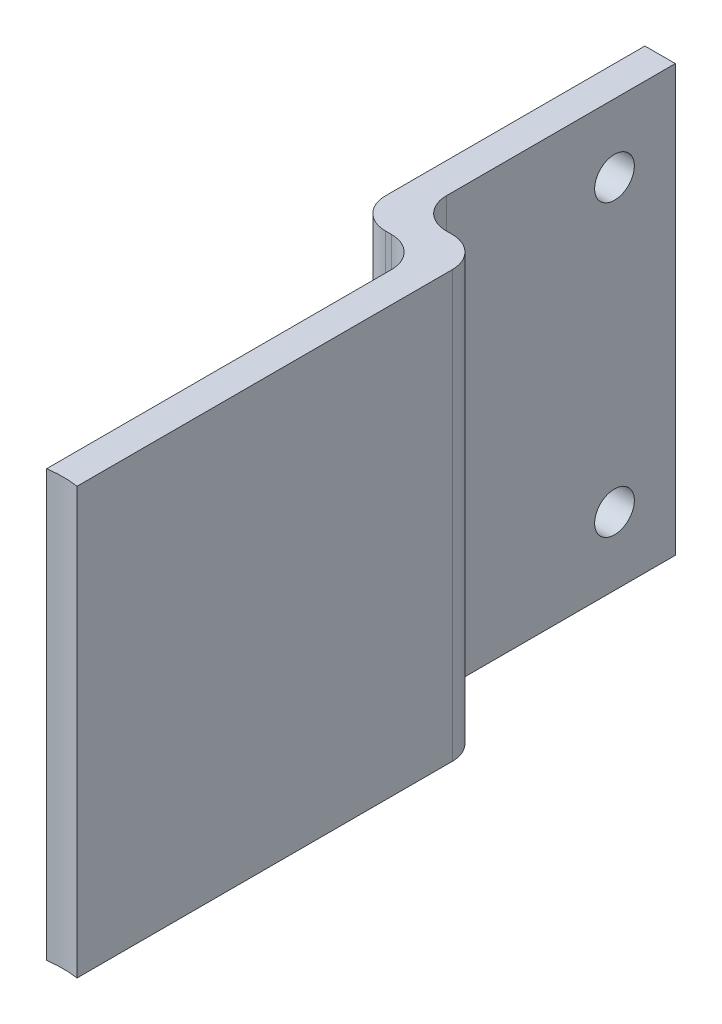
ISO-10303-21;
HEADER;
FILE_DESCRIPTION(('STEP AP214'),'2;1');
FILE_NAME('part.step','',(''),(''),'','','');
FILE_SCHEMA(('AUTOMOTIVE_DESIGN { 1 0 10303 214 1 1 1 1 }'));
ENDSEC;
DATA;
#1=APPLICATION_CONTEXT('core data for automotive mechanical design processes');
#2=APPLICATION_PROTOCOL_DEFINITION('international standard','automotive_design',2000,#1);
#3=PRODUCT_CONTEXT('',#1,'mechanical');
#4=PRODUCT('Part','Part','',(#3));
#5=PRODUCT_RELATED_PRODUCT_CATEGORY('part','',(#4));
#6=PRODUCT_DEFINITION_FORMATION('','',#4);
#7=PRODUCT_DEFINITION_CONTEXT('part definition',#1,'design');
#8=PRODUCT_DEFINITION('design','',#6,#7);
#9=PRODUCT_DEFINITION_SHAPE('','',#8);
#10=(LENGTH_UNIT() NAMED_UNIT(*) SI_UNIT(.MILLI.,.METRE.));
#11=(NAMED_UNIT(*) PLANE_ANGLE_UNIT() SI_UNIT($,.RADIAN.));
#12=(NAMED_UNIT(*) SI_UNIT($,.STERADIAN.) SOLID_ANGLE_UNIT());
#13=UNCERTAINTY_MEASURE_WITH_UNIT(LENGTH_MEASURE(1.E-05),#10,'distance_accuracy_value','');
#14=(GEOMETRIC_REPRESENTATION_CONTEXT(3) GLOBAL_UNCERTAINTY_ASSIGNED_CONTEXT((#13)) GLOBAL_UNIT_ASSIGNED_CONTEXT((#10,
#11,#12)) REPRESENTATION_CONTEXT('',''));
#15=CARTESIAN_POINT('',(0.,0.,0.));
#16=DIRECTION('',(0.,0.,1.));
#17=DIRECTION('',(1.,0.,0.));
#18=AXIS2_PLACEMENT_3D('',#15,#16,#17);
#19=CARTESIAN_POINT('',(5.,70.,0.));
#20=DIRECTION('',(-1.,0.,0.));
#21=DIRECTION('',(0.,0.,1.));
#22=AXIS2_PLACEMENT_3D('',#19,#20,#21);
#23=PLANE('',#22);
#24=DIRECTION('',(0.,0.,-1.));
#25=VECTOR('',#24,1.);
#26=CARTESIAN_POINT('',(5.,70.,0.));
#27=LINE('',#26,#25);
#28=CARTESIAN_POINT('',(5.00000000000001,70.,61.6794919243112));
#29=VERTEX_POINT('',#28);
#30=CARTESIAN_POINT('',(5.,70.,0.));
#31=VERTEX_POINT('',#30);
#32=EDGE_CURVE('E117',#29,#31,#27,.T.);
#33=ORIENTED_EDGE('',*,*,#32,.F.);
#34=DIRECTION('',(0.,1.,0.));
#35=VECTOR('',#34,1.);
#36=CARTESIAN_POINT('',(5.00000000000001,0.,61.6794919243112));
#37=LINE('',#36,#35);
#38=CARTESIAN_POINT('',(5.00000000000001,0.,61.6794919243112));
#39=VERTEX_POINT('',#38);
#40=EDGE_CURVE('E252',#29,#39,#37,.F.);
#41=ORIENTED_EDGE('',*,*,#40,.T.);
#42=DIRECTION('',(0.,0.,-1.));
#43=VECTOR('',#42,1.);
#44=CARTESIAN_POINT('',(5.,0.,0.));
#45=LINE('',#44,#43);
#46=CARTESIAN_POINT('',(5.,0.,0.));
#47=VERTEX_POINT('',#46);
#48=EDGE_CURVE('E169',#39,#47,#45,.T.);
#49=ORIENTED_EDGE('',*,*,#48,.T.);
#50=DIRECTION('',(0.,-1.,0.));
#51=VECTOR('',#50,1.);
#52=CARTESIAN_POINT('',(5.,70.,0.));
#53=LINE('',#52,#51);
#54=EDGE_CURVE('E13',#31,#47,#53,.T.);
#55=ORIENTED_EDGE('',*,*,#54,.F.);
#56=EDGE_LOOP('',(#33,#41,#49,#55));
#57=FACE_BOUND('',#56,.T.);
#58=ADVANCED_FACE('F45',(#57),#23,.F.);
#59=CARTESIAN_POINT('',(0.,70.,0.));
#60=DIRECTION('',(0.,-1.,0.));
#61=DIRECTION('',(0.,0.,-1.));
#62=AXIS2_PLACEMENT_3D('',#59,#60,#61);
#63=CYLINDRICAL_SURFACE('',#62,5.);
#64=CARTESIAN_POINT('',(0.,0.,0.));
#65=DIRECTION('',(0.,1.,0.));
#66=DIRECTION('',(0.,0.,1.));
#67=AXIS2_PLACEMENT_3D('',#64,#65,#66);
#68=CIRCLE('',#67,5.);
#69=CARTESIAN_POINT('',(0.,0.,-5.));
#70=VERTEX_POINT('',#69);
#71=EDGE_CURVE('E171',#47,#70,#68,.T.);
#72=ORIENTED_EDGE('',*,*,#71,.T.);
#73=DIRECTION('',(0.,-1.,0.));
#74=VECTOR('',#73,1.);
#75=CARTESIAN_POINT('',(0.,70.,-5.));
#76=LINE('',#75,#74);
#77=CARTESIAN_POINT('',(0.,70.,-5.));
#78=VERTEX_POINT('',#77);
#79=EDGE_CURVE('E53',#78,#70,#76,.T.);
#80=ORIENTED_EDGE('',*,*,#79,.F.);
#81=CARTESIAN_POINT('',(0.,70.,0.));
#82=DIRECTION('',(0.,1.,0.));
#83=DIRECTION('',(0.,0.,1.));
#84=AXIS2_PLACEMENT_3D('',#81,#82,#83);
#85=CIRCLE('',#84,5.);
#86=EDGE_CURVE('E221',#31,#78,#85,.T.);
#87=ORIENTED_EDGE('',*,*,#86,.F.);
#88=ORIENTED_EDGE('',*,*,#54,.T.);
#89=EDGE_LOOP('',(#72,#80,#87,#88));
#90=FACE_BOUND('',#89,.T.);
#91=ADVANCED_FACE('F265',(#90),#63,.T.);
#92=CARTESIAN_POINT('',(0.,70.,-5.));
#93=DIRECTION('',(0.,0.,1.));
#94=DIRECTION('',(1.,0.,0.));
#95=AXIS2_PLACEMENT_3D('',#92,#93,#94);
#96=PLANE('',#95);
#97=DIRECTION('',(-1.,0.,0.));
#98=VECTOR('',#97,1.);
#99=CARTESIAN_POINT('',(0.,0.,-5.));
#100=LINE('',#99,#98);
#101=CARTESIAN_POINT('',(-1.,0.,-5.));
#102=VERTEX_POINT('',#101);
#103=EDGE_CURVE('E174',#70,#102,#100,.T.);
#104=ORIENTED_EDGE('',*,*,#103,.T.);
#105=DIRECTION('',(0.,-1.,0.));
#106=VECTOR('',#105,1.);
#107=CARTESIAN_POINT('',(-1.,70.,-5.));
#108=LINE('',#107,#106);
#109=CARTESIAN_POINT('',(-1.,70.,-5.));
#110=VERTEX_POINT('',#109);
#111=EDGE_CURVE('E203',#110,#102,#108,.T.);
#112=ORIENTED_EDGE('',*,*,#111,.F.);
#113=DIRECTION('',(-1.,0.,0.));
#114=VECTOR('',#113,1.);
#115=CARTESIAN_POINT('',(0.,70.,-5.));
#116=LINE('',#115,#114);
#117=EDGE_CURVE('E223',#78,#110,#116,.T.);
#118=ORIENTED_EDGE('',*,*,#117,.F.);
#119=ORIENTED_EDGE('',*,*,#79,.T.);
#120=EDGE_LOOP('',(#104,#112,#118,#119));
#121=FACE_BOUND('',#120,.T.);
#122=ADVANCED_FACE('F271',(#121),#96,.F.);
#123=CARTESIAN_POINT('',(-1.,70.,-10.));
#124=DIRECTION('',(0.,-1.,0.));
#125=DIRECTION('',(0.,0.,-1.));
#126=AXIS2_PLACEMENT_3D('',#123,#124,#125);
#127=CYLINDRICAL_SURFACE('',#126,5.);
#128=CARTESIAN_POINT('',(-1.,0.,-10.));
#129=DIRECTION('',(0.,-1.,0.));
#130=DIRECTION('',(0.,0.,1.));
#131=AXIS2_PLACEMENT_3D('',#128,#129,#130);
#132=CIRCLE('',#131,5.);
#133=CARTESIAN_POINT('',(-6.,0.,-10.));
#134=VERTEX_POINT('',#133);
#135=EDGE_CURVE('E176',#102,#134,#132,.T.);
#136=ORIENTED_EDGE('',*,*,#135,.T.);
#137=DIRECTION('',(0.,-1.,0.));
#138=VECTOR('',#137,1.);
#139=CARTESIAN_POINT('',(-6.,70.,-10.));
#140=LINE('',#139,#138);
#141=CARTESIAN_POINT('',(-6.,70.,-10.));
#142=VERTEX_POINT('',#141);
#143=EDGE_CURVE('E200',#142,#134,#140,.T.);
#144=ORIENTED_EDGE('',*,*,#143,.F.);
#145=CARTESIAN_POINT('',(-1.,70.,-10.));
#146=DIRECTION('',(0.,-1.,0.));
#147=DIRECTION('',(0.,0.,1.));
#148=AXIS2_PLACEMENT_3D('',#145,#146,#147);
#149=CIRCLE('',#148,5.);
#150=EDGE_CURVE('E225',#110,#142,#149,.T.);
#151=ORIENTED_EDGE('',*,*,#150,.F.);
#152=ORIENTED_EDGE('',*,*,#111,.T.);
#153=EDGE_LOOP('',(#136,#144,#151,#152));
#154=FACE_BOUND('',#153,.T.);
#155=ADVANCED_FACE('F273',(#154),#127,.F.);
#156=CARTESIAN_POINT('',(-6.,70.,-10.));
#157=DIRECTION('',(-1.,0.,0.));
#158=DIRECTION('',(0.,0.,1.));
#159=AXIS2_PLACEMENT_3D('',#156,#157,#158);
#160=PLANE('',#159);
#161=CARTESIAN_POINT('',(-6.,11.1875,-37.65));
#162=DIRECTION('',(1.,0.,0.));
#163=DIRECTION('',(0.,0.,-1.));
#164=AXIS2_PLACEMENT_3D('',#161,#162,#163);
#165=CIRCLE('',#164,3.2639);
#166=CARTESIAN_POINT('',(-6.,11.1875,-40.9139));
#167=VERTEX_POINT('',#166);
#168=EDGE_CURVE('E216',#167,#167,#165,.T.);
#169=ORIENTED_EDGE('',*,*,#168,.F.);
#170=EDGE_LOOP('',(#169));
#171=FACE_BOUND('',#170,.T.);
#172=CARTESIAN_POINT('',(-6.,58.8125,-37.65));
#173=DIRECTION('',(1.,0.,0.));
#174=DIRECTION('',(0.,0.,-1.));
#175=AXIS2_PLACEMENT_3D('',#172,#173,#174);
#176=CIRCLE('',#175,3.2639);
#177=CARTESIAN_POINT('',(-6.,58.8125,-40.9139));
#178=VERTEX_POINT('',#177);
#179=EDGE_CURVE('E208',#178,#178,#176,.T.);
#180=ORIENTED_EDGE('',*,*,#179,.F.);
#181=EDGE_LOOP('',(#180));
#182=FACE_BOUND('',#181,.T.);
#183=DIRECTION('',(0.,0.,-1.));
#184=VECTOR('',#183,1.);
#185=CARTESIAN_POINT('',(-6.,0.,-10.));
#186=LINE('',#185,#184);
#187=CARTESIAN_POINT('',(-6.,0.,-47.65));
#188=VERTEX_POINT('',#187);
#189=EDGE_CURVE('E178',#134,#188,#186,.T.);
#190=ORIENTED_EDGE('',*,*,#189,.T.);
#191=DIRECTION('',(0.,-1.,0.));
#192=VECTOR('',#191,1.);
#193=CARTESIAN_POINT('',(-6.,70.,-47.65));
#194=LINE('',#193,#192);
#195=CARTESIAN_POINT('',(-6.,70.,-47.65));
#196=VERTEX_POINT('',#195);
#197=EDGE_CURVE('E197',#196,#188,#194,.T.);
#198=ORIENTED_EDGE('',*,*,#197,.F.);
#199=DIRECTION('',(0.,0.,-1.));
#200=VECTOR('',#199,1.);
#201=CARTESIAN_POINT('',(-6.,70.,-10.));
#202=LINE('',#201,#200);
#203=EDGE_CURVE('E227',#142,#196,#202,.T.);
#204=ORIENTED_EDGE('',*,*,#203,.F.);
#205=ORIENTED_EDGE('',*,*,#143,.T.);
#206=EDGE_LOOP('',(#190,#198,#204,#205));
#207=FACE_BOUND('',#206,.T.);
#208=ADVANCED_FACE('F276',(#171,#182,#207),#160,.F.);
#209=CARTESIAN_POINT('',(-11.,70.,-47.65));
#210=DIRECTION('',(0.,0.,1.));
#211=DIRECTION('',(1.,0.,0.));
#212=AXIS2_PLACEMENT_3D('',#209,#210,#211);
#213=PLANE('',#212);
#214=DIRECTION('',(-1.,0.,0.));
#215=VECTOR('',#214,1.);
#216=CARTESIAN_POINT('',(-11.,0.,-47.65));
#217=LINE('',#216,#215);
#218=CARTESIAN_POINT('',(-11.,0.,-47.65));
#219=VERTEX_POINT('',#218);
#220=EDGE_CURVE('E180',#188,#219,#217,.T.);
#221=ORIENTED_EDGE('',*,*,#220,.T.);
#222=DIRECTION('',(0.,-1.,0.));
#223=VECTOR('',#222,1.);
#224=CARTESIAN_POINT('',(-11.,70.,-47.65));
#225=LINE('',#224,#223);
#226=CARTESIAN_POINT('',(-11.,70.,-47.65));
#227=VERTEX_POINT('',#226);
#228=EDGE_CURVE('E194',#227,#219,#225,.T.);
#229=ORIENTED_EDGE('',*,*,#228,.F.);
#230=DIRECTION('',(-1.,0.,0.));
#231=VECTOR('',#230,1.);
#232=CARTESIAN_POINT('',(-11.,70.,-47.65));
#233=LINE('',#232,#231);
#234=EDGE_CURVE('E229',#196,#227,#233,.T.);
#235=ORIENTED_EDGE('',*,*,#234,.F.);
#236=ORIENTED_EDGE('',*,*,#197,.T.);
#237=EDGE_LOOP('',(#221,#229,#235,#236));
#238=FACE_BOUND('',#237,.T.);
#239=ADVANCED_FACE('F235',(#238),#213,.F.);
#240=CARTESIAN_POINT('',(-11.,70.,-5.));
#241=DIRECTION('',(1.,0.,0.));
#242=DIRECTION('',(0.,0.,-1.));
#243=AXIS2_PLACEMENT_3D('',#240,#241,#242);
#244=PLANE('',#243);
#245=CARTESIAN_POINT('',(-11.,11.1875,-37.65));
#246=DIRECTION('',(1.,0.,0.));
#247=DIRECTION('',(0.,0.,-1.));
#248=AXIS2_PLACEMENT_3D('',#245,#246,#247);
#249=CIRCLE('',#248,3.2639);
#250=CARTESIAN_POINT('',(-11.,11.1875,-40.9139));
#251=VERTEX_POINT('',#250);
#252=EDGE_CURVE('E48',#251,#251,#249,.T.);
#253=ORIENTED_EDGE('',*,*,#252,.T.);
#254=EDGE_LOOP('',(#253));
#255=FACE_BOUND('',#254,.T.);
#256=CARTESIAN_POINT('',(-11.,58.8125,-37.65));
#257=DIRECTION('',(1.,0.,0.));
#258=DIRECTION('',(0.,0.,-1.));
#259=AXIS2_PLACEMENT_3D('',#256,#257,#258);
#260=CIRCLE('',#259,3.2639);
#261=CARTESIAN_POINT('',(-11.,58.8125,-40.9139));
#262=VERTEX_POINT('',#261);
#263=EDGE_CURVE('E172',#262,#262,#260,.T.);
#264=ORIENTED_EDGE('',*,*,#263,.T.);
#265=EDGE_LOOP('',(#264));
#266=FACE_BOUND('',#265,.T.);
#267=DIRECTION('',(0.,0.,1.));
#268=VECTOR('',#267,1.);
#269=CARTESIAN_POINT('',(-11.,0.,-5.));
#270=LINE('',#269,#268);
#271=CARTESIAN_POINT('',(-11.,0.,-5.));
#272=VERTEX_POINT('',#271);
#273=EDGE_CURVE('E182',#219,#272,#270,.T.);
#274=ORIENTED_EDGE('',*,*,#273,.T.);
#275=DIRECTION('',(0.,-1.,0.));
#276=VECTOR('',#275,1.);
#277=CARTESIAN_POINT('',(-11.,70.,-5.));
#278=LINE('',#277,#276);
#279=CARTESIAN_POINT('',(-11.,70.,-5.));
#280=VERTEX_POINT('',#279);
#281=EDGE_CURVE('E158',#280,#272,#278,.T.);
#282=ORIENTED_EDGE('',*,*,#281,.F.);
#283=DIRECTION('',(0.,0.,1.));
#284=VECTOR('',#283,1.);
#285=CARTESIAN_POINT('',(-11.,70.,-5.));
#286=LINE('',#285,#284);
#287=EDGE_CURVE('E146',#227,#280,#286,.T.);
#288=ORIENTED_EDGE('',*,*,#287,.F.);
#289=ORIENTED_EDGE('',*,*,#228,.T.);
#290=EDGE_LOOP('',(#274,#282,#288,#289));
#291=FACE_BOUND('',#290,.T.);
#292=ADVANCED_FACE('F239',(#255,#266,#291),#244,.F.);
#293=CARTESIAN_POINT('',(-6.,70.,-5.));
#294=DIRECTION('',(0.,-1.,0.));
#295=DIRECTION('',(0.,0.,-1.));
#296=AXIS2_PLACEMENT_3D('',#293,#294,#295);
#297=CYLINDRICAL_SURFACE('',#296,5.);
#298=CARTESIAN_POINT('',(-6.,0.,-5.));
#299=DIRECTION('',(0.,1.,0.));
#300=DIRECTION('',(0.,0.,-1.));
#301=AXIS2_PLACEMENT_3D('',#298,#299,#300);
#302=CIRCLE('',#301,5.);
#303=CARTESIAN_POINT('',(-6.,0.,0.));
#304=VERTEX_POINT('',#303);
#305=EDGE_CURVE('E155',#272,#304,#302,.T.);
#306=ORIENTED_EDGE('',*,*,#305,.T.);
#307=DIRECTION('',(0.,-1.,0.));
#308=VECTOR('',#307,1.);
#309=CARTESIAN_POINT('',(-6.,70.,0.));
#310=LINE('',#309,#308);
#311=CARTESIAN_POINT('',(-6.,70.,0.));
#312=VERTEX_POINT('',#311);
#313=EDGE_CURVE('E152',#312,#304,#310,.T.);
#314=ORIENTED_EDGE('',*,*,#313,.F.);
#315=CARTESIAN_POINT('',(-6.,70.,-5.));
#316=DIRECTION('',(0.,1.,0.));
#317=DIRECTION('',(0.,0.,-1.));
#318=AXIS2_PLACEMENT_3D('',#315,#316,#317);
#319=CIRCLE('',#318,5.);
#320=EDGE_CURVE('E139',#280,#312,#319,.T.);
#321=ORIENTED_EDGE('',*,*,#320,.F.);
#322=ORIENTED_EDGE('',*,*,#281,.T.);
#323=EDGE_LOOP('',(#306,#314,#321,#322));
#324=FACE_BOUND('',#323,.T.);
#325=ADVANCED_FACE('F153',(#324),#297,.T.);
#326=CARTESIAN_POINT('',(-5.,70.,0.));
#327=DIRECTION('',(0.,0.,-1.));
#328=DIRECTION('',(-1.,0.,0.));
#329=AXIS2_PLACEMENT_3D('',#326,#327,#328);
#330=PLANE('',#329);
#331=DIRECTION('',(1.,0.,0.));
#332=VECTOR('',#331,1.);
#333=CARTESIAN_POINT('',(-5.,0.,0.));
#334=LINE('',#333,#332);
#335=CARTESIAN_POINT('',(-5.,0.,0.));
#336=VERTEX_POINT('',#335);
#337=EDGE_CURVE('E185',#304,#336,#334,.T.);
#338=ORIENTED_EDGE('',*,*,#337,.T.);
#339=DIRECTION('',(0.,-1.,0.));
#340=VECTOR('',#339,1.);
#341=CARTESIAN_POINT('',(-5.,70.,0.));
#342=LINE('',#341,#340);
#343=CARTESIAN_POINT('',(-5.,70.,0.));
#344=VERTEX_POINT('',#343);
#345=EDGE_CURVE('E159',#344,#336,#342,.T.);
#346=ORIENTED_EDGE('',*,*,#345,.F.);
#347=DIRECTION('',(1.,0.,0.));
#348=VECTOR('',#347,1.);
#349=CARTESIAN_POINT('',(-5.,70.,0.));
#350=LINE('',#349,#348);
#351=EDGE_CURVE('E143',#312,#344,#350,.T.);
#352=ORIENTED_EDGE('',*,*,#351,.F.);
#353=ORIENTED_EDGE('',*,*,#313,.T.);
#354=EDGE_LOOP('',(#338,#346,#352,#353));
#355=FACE_BOUND('',#354,.T.);
#356=ADVANCED_FACE('F161',(#355),#330,.F.);
#357=CARTESIAN_POINT('',(-5.,70.,5.));
#358=DIRECTION('',(0.,-1.,0.));
#359=DIRECTION('',(0.,0.,-1.));
#360=AXIS2_PLACEMENT_3D('',#357,#358,#359);
#361=CYLINDRICAL_SURFACE('',#360,5.);
#362=CARTESIAN_POINT('',(-5.,0.,5.));
#363=DIRECTION('',(0.,-1.,0.));
#364=DIRECTION('',(0.,0.,-1.));
#365=AXIS2_PLACEMENT_3D('',#362,#363,#364);
#366=CIRCLE('',#365,5.);
#367=CARTESIAN_POINT('',(0.,0.,5.));
#368=VERTEX_POINT('',#367);
#369=EDGE_CURVE('E109',#336,#368,#366,.T.);
#370=ORIENTED_EDGE('',*,*,#369,.T.);
#371=DIRECTION('',(0.,-1.,0.));
#372=VECTOR('',#371,1.);
#373=CARTESIAN_POINT('',(0.,70.,5.));
#374=LINE('',#373,#372);
#375=CARTESIAN_POINT('',(0.,70.,5.));
#376=VERTEX_POINT('',#375);
#377=EDGE_CURVE('E168',#376,#368,#374,.T.);
#378=ORIENTED_EDGE('',*,*,#377,.F.);
#379=CARTESIAN_POINT('',(-5.,70.,5.));
#380=DIRECTION('',(0.,-1.,0.));
#381=DIRECTION('',(0.,0.,-1.));
#382=AXIS2_PLACEMENT_3D('',#379,#380,#381);
#383=CIRCLE('',#382,5.);
#384=EDGE_CURVE('E70',#344,#376,#383,.T.);
#385=ORIENTED_EDGE('',*,*,#384,.F.);
#386=ORIENTED_EDGE('',*,*,#345,.T.);
#387=EDGE_LOOP('',(#370,#378,#385,#386));
#388=FACE_BOUND('',#387,.T.);
#389=ADVANCED_FACE('F243',(#388),#361,.F.);
#390=CARTESIAN_POINT('',(0.,70.,5.));
#391=DIRECTION('',(1.,0.,0.));
#392=DIRECTION('',(0.,0.,-1.));
#393=AXIS2_PLACEMENT_3D('',#390,#391,#392);
#394=PLANE('',#393);
#395=DIRECTION('',(0.,0.,1.));
#396=VECTOR('',#395,1.);
#397=CARTESIAN_POINT('',(0.,0.,5.));
#398=LINE('',#397,#396);
#399=CARTESIAN_POINT('',(0.,0.,61.6794919243112));
#400=VERTEX_POINT('',#399);
#401=EDGE_CURVE('E188',#368,#400,#398,.T.);
#402=ORIENTED_EDGE('',*,*,#401,.T.);
#403=DIRECTION('',(0.,1.,0.));
#404=VECTOR('',#403,1.);
#405=CARTESIAN_POINT('',(0.,0.,61.6794919243112));
#406=LINE('',#405,#404);
#407=CARTESIAN_POINT('',(0.,70.,61.6794919243112));
#408=VERTEX_POINT('',#407);
#409=EDGE_CURVE('E61',#400,#408,#406,.T.);
#410=ORIENTED_EDGE('',*,*,#409,.T.);
#411=DIRECTION('',(0.,0.,1.));
#412=VECTOR('',#411,1.);
#413=CARTESIAN_POINT('',(0.,70.,5.));
#414=LINE('',#413,#412);
#415=EDGE_CURVE('E163',#376,#408,#414,.T.);
#416=ORIENTED_EDGE('',*,*,#415,.F.);
#417=ORIENTED_EDGE('',*,*,#377,.T.);
#418=EDGE_LOOP('',(#402,#410,#416,#417));
#419=FACE_BOUND('',#418,.T.);
#420=ADVANCED_FACE('F246',(#419),#394,.F.);
#421=CARTESIAN_POINT('',(-5.,70.,5.));
#422=DIRECTION('',(0.,-1.,0.));
#423=DIRECTION('',(0.,0.,-1.));
#424=AXIS2_PLACEMENT_3D('',#421,#422,#423);
#425=PLANE('',#424);
#426=ORIENTED_EDGE('',*,*,#415,.T.);
#427=CARTESIAN_POINT('',(2.50000000000001,70.,79.));
#428=DIRECTION('',(0.,1.,0.));
#429=DIRECTION('',(0.,0.,1.));
#430=AXIS2_PLACEMENT_3D('',#427,#428,#429);
#431=CIRCLE('',#430,17.5);
#432=EDGE_CURVE('E248',#29,#408,#431,.T.);
#433=ORIENTED_EDGE('',*,*,#432,.F.);
#434=ORIENTED_EDGE('',*,*,#32,.T.);
#435=ORIENTED_EDGE('',*,*,#86,.T.);
#436=ORIENTED_EDGE('',*,*,#117,.T.);
#437=ORIENTED_EDGE('',*,*,#150,.T.);
#438=ORIENTED_EDGE('',*,*,#203,.T.);
#439=ORIENTED_EDGE('',*,*,#234,.T.);
#440=ORIENTED_EDGE('',*,*,#287,.T.);
#441=ORIENTED_EDGE('',*,*,#320,.T.);
#442=ORIENTED_EDGE('',*,*,#351,.T.);
#443=ORIENTED_EDGE('',*,*,#384,.T.);
#444=EDGE_LOOP('',(#426,#433,#434,#435,#436,#437,#438,#439,#440,#441,#442,#443));
#445=FACE_BOUND('',#444,.T.);
#446=ADVANCED_FACE('F141',(#445),#425,.F.);
#447=CARTESIAN_POINT('',(-5.,0.,5.));
#448=DIRECTION('',(0.,-1.,0.));
#449=DIRECTION('',(0.,0.,-1.));
#450=AXIS2_PLACEMENT_3D('',#447,#448,#449);
#451=PLANE('',#450);
#452=CARTESIAN_POINT('',(2.50000000000001,0.,79.));
#453=DIRECTION('',(0.,1.,0.));
#454=DIRECTION('',(0.,0.,1.));
#455=AXIS2_PLACEMENT_3D('',#452,#453,#454);
#456=CIRCLE('',#455,17.5);
#457=EDGE_CURVE('E254',#39,#400,#456,.T.);
#458=ORIENTED_EDGE('',*,*,#457,.T.);
#459=ORIENTED_EDGE('',*,*,#401,.F.);
#460=ORIENTED_EDGE('',*,*,#369,.F.);
#461=ORIENTED_EDGE('',*,*,#337,.F.);
#462=ORIENTED_EDGE('',*,*,#305,.F.);
#463=ORIENTED_EDGE('',*,*,#273,.F.);
#464=ORIENTED_EDGE('',*,*,#220,.F.);
#465=ORIENTED_EDGE('',*,*,#189,.F.);
#466=ORIENTED_EDGE('',*,*,#135,.F.);
#467=ORIENTED_EDGE('',*,*,#103,.F.);
#468=ORIENTED_EDGE('',*,*,#71,.F.);
#469=ORIENTED_EDGE('',*,*,#48,.F.);
#470=EDGE_LOOP('',(#458,#459,#460,#461,#462,#463,#464,#465,#466,#467,#468,#469));
#471=FACE_BOUND('',#470,.T.);
#472=ADVANCED_FACE('F241',(#471),#451,.T.);
#473=CARTESIAN_POINT('',(-76.,58.8125,-37.65));
#474=DIRECTION('',(1.,0.,0.));
#475=DIRECTION('',(0.,0.,-1.));
#476=AXIS2_PLACEMENT_3D('',#473,#474,#475);
#477=CYLINDRICAL_SURFACE('',#476,3.2639);
#478=ORIENTED_EDGE('',*,*,#179,.T.);
#479=EDGE_LOOP('',(#478));
#480=FACE_BOUND('',#479,.T.);
#481=ORIENTED_EDGE('',*,*,#263,.F.);
#482=EDGE_LOOP('',(#481));
#483=FACE_BOUND('',#482,.T.);
#484=ADVANCED_FACE('F352',(#480,#483),#477,.F.);
#485=CARTESIAN_POINT('',(-76.,11.1875,-37.65));
#486=DIRECTION('',(1.,0.,0.));
#487=DIRECTION('',(0.,0.,-1.));
#488=AXIS2_PLACEMENT_3D('',#485,#486,#487);
#489=CYLINDRICAL_SURFACE('',#488,3.2639);
#490=ORIENTED_EDGE('',*,*,#168,.T.);
#491=EDGE_LOOP('',(#490));
#492=FACE_BOUND('',#491,.T.);
#493=ORIENTED_EDGE('',*,*,#252,.F.);
#494=EDGE_LOOP('',(#493));
#495=FACE_BOUND('',#494,.T.);
#496=ADVANCED_FACE('F357',(#492,#495),#489,.F.);
#497=CARTESIAN_POINT('',(2.50000000000001,0.,79.));
#498=DIRECTION('',(0.,1.,0.));
#499=DIRECTION('',(0.,0.,1.));
#500=AXIS2_PLACEMENT_3D('',#497,#498,#499);
#501=CYLINDRICAL_SURFACE('',#500,17.5);
#502=ORIENTED_EDGE('',*,*,#432,.T.);
#503=ORIENTED_EDGE('',*,*,#409,.F.);
#504=ORIENTED_EDGE('',*,*,#457,.F.);
#505=ORIENTED_EDGE('',*,*,#40,.F.);
#506=EDGE_LOOP('',(#502,#503,#504,#505));
#507=FACE_BOUND('',#506,.T.);
#508=ADVANCED_FACE('F255',(#507),#501,.F.);
#509=CLOSED_SHELL('',(#58,#91,#122,#155,#208,#239,#292,#325,#356,#389,#420,#446,#472,#484,#496,#508));
#510=MANIFOLD_SOLID_BREP('B2',#509);
#511=ADVANCED_BREP_SHAPE_REPRESENTATION('',(#18,#510),#14);
#512=SHAPE_DEFINITION_REPRESENTATION(#9,#511);
ENDSEC;
END-ISO-10303-21;
